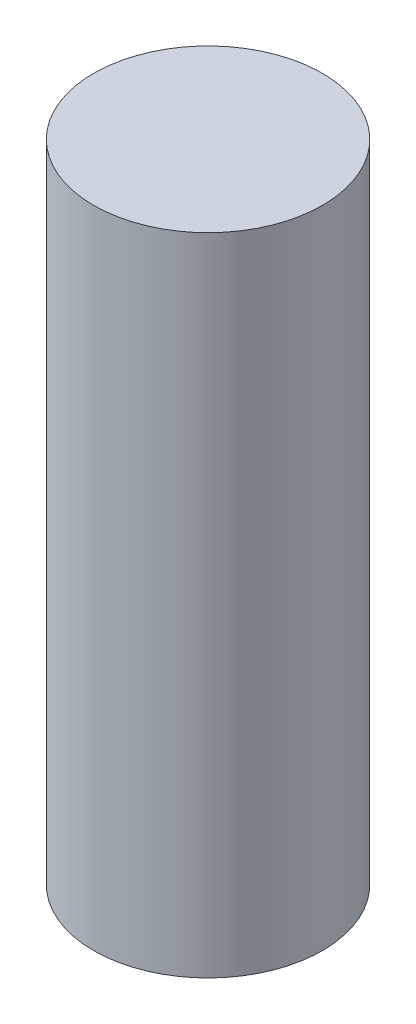
ISO-10303-21;
HEADER;
FILE_DESCRIPTION(('STEP AP214'),'2;1');
FILE_NAME('part.step','',(''),(''),'','','');
FILE_SCHEMA(('AUTOMOTIVE_DESIGN { 1 0 10303 214 1 1 1 1 }'));
ENDSEC;
DATA;
#1=APPLICATION_CONTEXT('core data for automotive mechanical design processes');
#2=APPLICATION_PROTOCOL_DEFINITION('international standard','automotive_design',2000,#1);
#3=PRODUCT_CONTEXT('',#1,'mechanical');
#4=PRODUCT('Part','Part','',(#3));
#5=PRODUCT_RELATED_PRODUCT_CATEGORY('part','',(#4));
#6=PRODUCT_DEFINITION_FORMATION('','',#4);
#7=PRODUCT_DEFINITION_CONTEXT('part definition',#1,'design');
#8=PRODUCT_DEFINITION('design','',#6,#7);
#9=PRODUCT_DEFINITION_SHAPE('','',#8);
#10=(LENGTH_UNIT() NAMED_UNIT(*) SI_UNIT(.MILLI.,.METRE.));
#11=(NAMED_UNIT(*) PLANE_ANGLE_UNIT() SI_UNIT($,.RADIAN.));
#12=(NAMED_UNIT(*) SI_UNIT($,.STERADIAN.) SOLID_ANGLE_UNIT());
#13=UNCERTAINTY_MEASURE_WITH_UNIT(LENGTH_MEASURE(1.E-05),#10,'distance_accuracy_value','');
#14=(GEOMETRIC_REPRESENTATION_CONTEXT(3) GLOBAL_UNCERTAINTY_ASSIGNED_CONTEXT((#13)) GLOBAL_UNIT_ASSIGNED_CONTEXT((#10,
#11,#12)) REPRESENTATION_CONTEXT('',''));
#15=CARTESIAN_POINT('',(0.,0.,0.));
#16=DIRECTION('',(0.,0.,1.));
#17=DIRECTION('',(1.,0.,0.));
#18=AXIS2_PLACEMENT_3D('',#15,#16,#17);
#19=CARTESIAN_POINT('',(0.,42.3556733350911,0.));
#20=DIRECTION('',(0.,-1.,0.));
#21=DIRECTION('',(0.,0.,-1.));
#22=AXIS2_PLACEMENT_3D('',#19,#20,#21);
#23=CYLINDRICAL_SURFACE('',#22,5.);
#24=CARTESIAN_POINT('',(0.,0.,0.));
#25=DIRECTION('',(0.,1.,0.));
#26=DIRECTION('',(0.,0.,1.));
#27=AXIS2_PLACEMENT_3D('',#24,#25,#26);
#28=CIRCLE('',#27,5.);
#29=CARTESIAN_POINT('',(0.,0.,5.));
#30=VERTEX_POINT('',#29);
#31=EDGE_CURVE('E43',#30,#30,#28,.T.);
#32=ORIENTED_EDGE('',*,*,#31,.T.);
#33=EDGE_LOOP('',(#32));
#34=FACE_BOUND('',#33,.T.);
#35=CARTESIAN_POINT('',(0.,28.2135377113602,0.));
#36=DIRECTION('',(0.,1.,0.));
#37=DIRECTION('',(0.,0.,1.));
#38=AXIS2_PLACEMENT_3D('',#35,#36,#37);
#39=CIRCLE('',#38,5.);
#40=CARTESIAN_POINT('',(0.,28.2135377113602,5.));
#41=VERTEX_POINT('',#40);
#42=EDGE_CURVE('E10',#41,#41,#39,.T.);
#43=ORIENTED_EDGE('',*,*,#42,.F.);
#44=EDGE_LOOP('',(#43));
#45=FACE_BOUND('',#44,.T.);
#46=ADVANCED_FACE('F35',(#34,#45),#23,.T.);
#47=CARTESIAN_POINT('',(0.,0.,0.));
#48=DIRECTION('',(0.,1.,0.));
#49=DIRECTION('',(0.,0.,1.));
#50=AXIS2_PLACEMENT_3D('',#47,#48,#49);
#51=PLANE('',#50);
#52=ORIENTED_EDGE('',*,*,#31,.F.);
#53=EDGE_LOOP('',(#52));
#54=FACE_BOUND('',#53,.T.);
#55=ADVANCED_FACE('F54',(#54),#51,.F.);
#56=CARTESIAN_POINT('',(-20.,28.2135377113602,8.00000000000001));
#57=DIRECTION('',(0.,1.,0.));
#58=DIRECTION('',(1.,0.,0.));
#59=AXIS2_PLACEMENT_3D('',#56,#57,#58);
#60=PLANE('',#59);
#61=ORIENTED_EDGE('',*,*,#42,.T.);
#62=EDGE_LOOP('',(#61));
#63=FACE_BOUND('',#62,.T.);
#64=ADVANCED_FACE('F37',(#63),#60,.T.);
#65=CLOSED_SHELL('',(#46,#55,#64));
#66=MANIFOLD_SOLID_BREP('B2',#65);
#67=ADVANCED_BREP_SHAPE_REPRESENTATION('',(#18,#66),#14);
#68=SHAPE_DEFINITION_REPRESENTATION(#9,#67);
ENDSEC;
END-ISO-10303-21;
